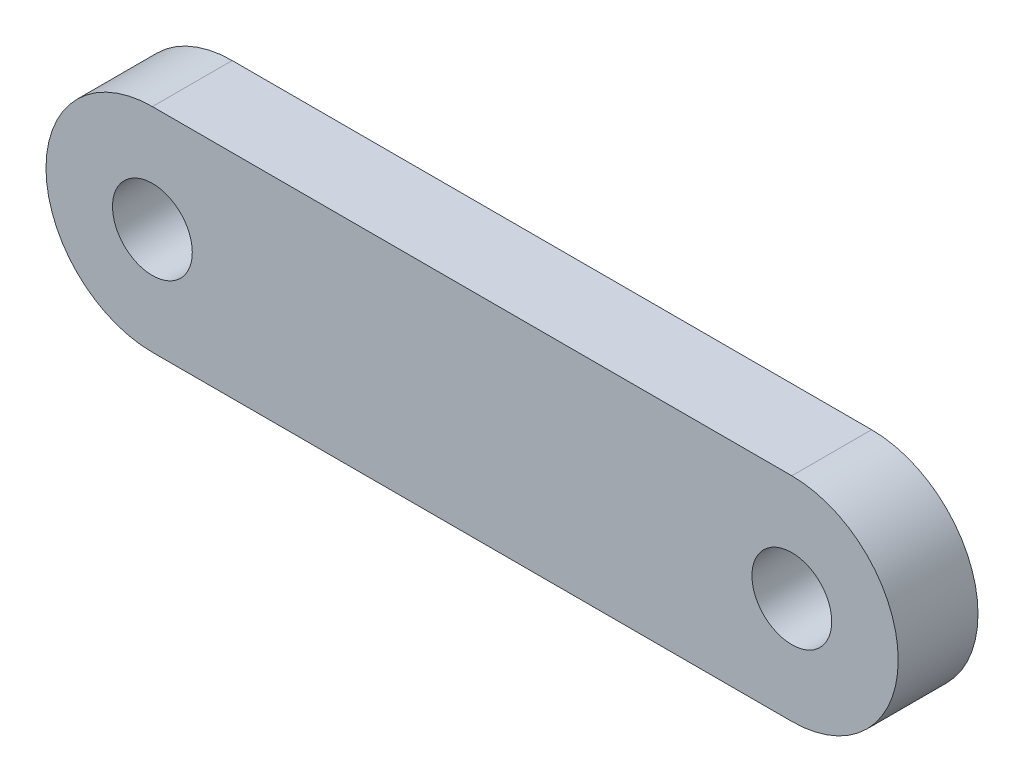
ISO-10303-21;
HEADER;
FILE_DESCRIPTION(('STEP AP214'),'2;1');
FILE_NAME('part.step','',(''),(''),'','','');
FILE_SCHEMA(('AUTOMOTIVE_DESIGN { 1 0 10303 214 1 1 1 1 }'));
ENDSEC;
DATA;
#1=APPLICATION_CONTEXT('core data for automotive mechanical design processes');
#2=APPLICATION_PROTOCOL_DEFINITION('international standard','automotive_design',2000,#1);
#3=PRODUCT_CONTEXT('',#1,'mechanical');
#4=PRODUCT('Part','Part','',(#3));
#5=PRODUCT_RELATED_PRODUCT_CATEGORY('part','',(#4));
#6=PRODUCT_DEFINITION_FORMATION('','',#4);
#7=PRODUCT_DEFINITION_CONTEXT('part definition',#1,'design');
#8=PRODUCT_DEFINITION('design','',#6,#7);
#9=PRODUCT_DEFINITION_SHAPE('','',#8);
#10=(LENGTH_UNIT() NAMED_UNIT(*) SI_UNIT(.MILLI.,.METRE.));
#11=(NAMED_UNIT(*) PLANE_ANGLE_UNIT() SI_UNIT($,.RADIAN.));
#12=(NAMED_UNIT(*) SI_UNIT($,.STERADIAN.) SOLID_ANGLE_UNIT());
#13=UNCERTAINTY_MEASURE_WITH_UNIT(LENGTH_MEASURE(1.E-05),#10,'distance_accuracy_value','');
#14=(GEOMETRIC_REPRESENTATION_CONTEXT(3) GLOBAL_UNCERTAINTY_ASSIGNED_CONTEXT((#13)) GLOBAL_UNIT_ASSIGNED_CONTEXT((#10,
#11,#12)) REPRESENTATION_CONTEXT('',''));
#15=CARTESIAN_POINT('',(0.,0.,0.));
#16=DIRECTION('',(0.,0.,1.));
#17=DIRECTION('',(1.,0.,0.));
#18=AXIS2_PLACEMENT_3D('',#15,#16,#17);
#19=CARTESIAN_POINT('',(0.,0.,0.75));
#20=DIRECTION('',(0.,0.,1.));
#21=DIRECTION('',(1.,0.,0.));
#22=AXIS2_PLACEMENT_3D('',#19,#20,#21);
#23=PLANE('',#22);
#24=CARTESIAN_POINT('',(0.,0.,0.75));
#25=DIRECTION('',(0.,0.,1.));
#26=DIRECTION('',(1.,0.,0.));
#27=AXIS2_PLACEMENT_3D('',#24,#25,#26);
#28=CIRCLE('',#27,0.75);
#29=CARTESIAN_POINT('',(0.75,0.,0.75));
#30=VERTEX_POINT('',#29);
#31=EDGE_CURVE('E101',#30,#30,#28,.T.);
#32=ORIENTED_EDGE('',*,*,#31,.F.);
#33=EDGE_LOOP('',(#32));
#34=FACE_BOUND('',#33,.T.);
#35=CARTESIAN_POINT('',(0.,0.,0.75));
#36=DIRECTION('',(0.,0.,1.));
#37=DIRECTION('',(1.,0.,0.));
#38=AXIS2_PLACEMENT_3D('',#35,#36,#37);
#39=CIRCLE('',#38,2.);
#40=CARTESIAN_POINT('',(0.,2.,0.75));
#41=VERTEX_POINT('',#40);
#42=CARTESIAN_POINT('',(0.,-2.,0.75));
#43=VERTEX_POINT('',#42);
#44=EDGE_CURVE('E86',#41,#43,#39,.T.);
#45=ORIENTED_EDGE('',*,*,#44,.T.);
#46=DIRECTION('',(1.,0.,0.));
#47=VECTOR('',#46,1.);
#48=CARTESIAN_POINT('',(0.,-2.,0.75));
#49=LINE('',#48,#47);
#50=CARTESIAN_POINT('',(12.02,-2.,0.75));
#51=VERTEX_POINT('',#50);
#52=EDGE_CURVE('E81',#43,#51,#49,.T.);
#53=ORIENTED_EDGE('',*,*,#52,.T.);
#54=CARTESIAN_POINT('',(12.02,0.,0.75));
#55=DIRECTION('',(0.,0.,1.));
#56=DIRECTION('',(1.,0.,0.));
#57=AXIS2_PLACEMENT_3D('',#54,#55,#56);
#58=CIRCLE('',#57,2.);
#59=CARTESIAN_POINT('',(12.02,2.,0.75));
#60=VERTEX_POINT('',#59);
#61=EDGE_CURVE('E84',#51,#60,#58,.T.);
#62=ORIENTED_EDGE('',*,*,#61,.T.);
#63=DIRECTION('',(-1.,0.,0.));
#64=VECTOR('',#63,1.);
#65=CARTESIAN_POINT('',(0.,2.,0.75));
#66=LINE('',#65,#64);
#67=EDGE_CURVE('E51',#60,#41,#66,.T.);
#68=ORIENTED_EDGE('',*,*,#67,.T.);
#69=EDGE_LOOP('',(#45,#53,#62,#68));
#70=FACE_BOUND('',#69,.T.);
#71=CARTESIAN_POINT('',(12.02,0.,0.75));
#72=DIRECTION('',(0.,0.,1.));
#73=DIRECTION('',(1.,0.,0.));
#74=AXIS2_PLACEMENT_3D('',#71,#72,#73);
#75=CIRCLE('',#74,0.750000000000002);
#76=CARTESIAN_POINT('',(12.77,0.,0.75));
#77=VERTEX_POINT('',#76);
#78=EDGE_CURVE('E116',#77,#77,#75,.T.);
#79=ORIENTED_EDGE('',*,*,#78,.F.);
#80=EDGE_LOOP('',(#79));
#81=FACE_BOUND('',#80,.T.);
#82=ADVANCED_FACE('F34',(#34,#70,#81),#23,.T.);
#83=CARTESIAN_POINT('',(0.,0.,-0.75));
#84=DIRECTION('',(0.,0.,1.));
#85=DIRECTION('',(1.,0.,0.));
#86=AXIS2_PLACEMENT_3D('',#83,#84,#85);
#87=PLANE('',#86);
#88=CARTESIAN_POINT('',(0.,0.,-0.75));
#89=DIRECTION('',(0.,0.,1.));
#90=DIRECTION('',(1.,0.,0.));
#91=AXIS2_PLACEMENT_3D('',#88,#89,#90);
#92=CIRCLE('',#91,2.);
#93=CARTESIAN_POINT('',(0.,2.,-0.75));
#94=VERTEX_POINT('',#93);
#95=CARTESIAN_POINT('',(0.,-2.,-0.75));
#96=VERTEX_POINT('',#95);
#97=EDGE_CURVE('E98',#94,#96,#92,.T.);
#98=ORIENTED_EDGE('',*,*,#97,.F.);
#99=DIRECTION('',(-1.,0.,0.));
#100=VECTOR('',#99,1.);
#101=CARTESIAN_POINT('',(0.,2.,-0.75));
#102=LINE('',#101,#100);
#103=CARTESIAN_POINT('',(12.02,2.,-0.75));
#104=VERTEX_POINT('',#103);
#105=EDGE_CURVE('E74',#104,#94,#102,.T.);
#106=ORIENTED_EDGE('',*,*,#105,.F.);
#107=CARTESIAN_POINT('',(12.02,0.,-0.75));
#108=DIRECTION('',(0.,0.,1.));
#109=DIRECTION('',(1.,0.,0.));
#110=AXIS2_PLACEMENT_3D('',#107,#108,#109);
#111=CIRCLE('',#110,2.);
#112=CARTESIAN_POINT('',(12.02,-2.,-0.75));
#113=VERTEX_POINT('',#112);
#114=EDGE_CURVE('E68',#113,#104,#111,.T.);
#115=ORIENTED_EDGE('',*,*,#114,.F.);
#116=DIRECTION('',(1.,0.,0.));
#117=VECTOR('',#116,1.);
#118=CARTESIAN_POINT('',(0.,-2.,-0.75));
#119=LINE('',#118,#117);
#120=EDGE_CURVE('E90',#96,#113,#119,.T.);
#121=ORIENTED_EDGE('',*,*,#120,.F.);
#122=EDGE_LOOP('',(#98,#106,#115,#121));
#123=FACE_BOUND('',#122,.T.);
#124=CARTESIAN_POINT('',(0.,0.,-0.75));
#125=DIRECTION('',(0.,0.,1.));
#126=DIRECTION('',(1.,0.,0.));
#127=AXIS2_PLACEMENT_3D('',#124,#125,#126);
#128=CIRCLE('',#127,0.75);
#129=CARTESIAN_POINT('',(0.75,0.,-0.75));
#130=VERTEX_POINT('',#129);
#131=EDGE_CURVE('E113',#130,#130,#128,.T.);
#132=ORIENTED_EDGE('',*,*,#131,.T.);
#133=EDGE_LOOP('',(#132));
#134=FACE_BOUND('',#133,.T.);
#135=CARTESIAN_POINT('',(12.02,0.,-0.75));
#136=DIRECTION('',(0.,0.,1.));
#137=DIRECTION('',(1.,0.,0.));
#138=AXIS2_PLACEMENT_3D('',#135,#136,#137);
#139=CIRCLE('',#138,0.750000000000002);
#140=CARTESIAN_POINT('',(12.77,0.,-0.75));
#141=VERTEX_POINT('',#140);
#142=EDGE_CURVE('E119',#141,#141,#139,.T.);
#143=ORIENTED_EDGE('',*,*,#142,.T.);
#144=EDGE_LOOP('',(#143));
#145=FACE_BOUND('',#144,.T.);
#146=ADVANCED_FACE('F109',(#123,#134,#145),#87,.F.);
#147=CARTESIAN_POINT('',(0.,0.,0.75));
#148=DIRECTION('',(0.,0.,-1.));
#149=DIRECTION('',(-1.,0.,0.));
#150=AXIS2_PLACEMENT_3D('',#147,#148,#149);
#151=CYLINDRICAL_SURFACE('',#150,2.);
#152=ORIENTED_EDGE('',*,*,#97,.T.);
#153=DIRECTION('',(0.,0.,-1.));
#154=VECTOR('',#153,1.);
#155=CARTESIAN_POINT('',(0.,-2.,0.75));
#156=LINE('',#155,#154);
#157=EDGE_CURVE('E11',#43,#96,#156,.T.);
#158=ORIENTED_EDGE('',*,*,#157,.F.);
#159=ORIENTED_EDGE('',*,*,#44,.F.);
#160=DIRECTION('',(0.,0.,-1.));
#161=VECTOR('',#160,1.);
#162=CARTESIAN_POINT('',(0.,2.,0.75));
#163=LINE('',#162,#161);
#164=EDGE_CURVE('E94',#41,#94,#163,.T.);
#165=ORIENTED_EDGE('',*,*,#164,.T.);
#166=EDGE_LOOP('',(#152,#158,#159,#165));
#167=FACE_BOUND('',#166,.T.);
#168=ADVANCED_FACE('F36',(#167),#151,.T.);
#169=CARTESIAN_POINT('',(0.,-2.,0.75));
#170=DIRECTION('',(0.,1.,0.));
#171=DIRECTION('',(0.,0.,1.));
#172=AXIS2_PLACEMENT_3D('',#169,#170,#171);
#173=PLANE('',#172);
#174=ORIENTED_EDGE('',*,*,#120,.T.);
#175=DIRECTION('',(0.,0.,-1.));
#176=VECTOR('',#175,1.);
#177=CARTESIAN_POINT('',(12.02,-2.,0.75));
#178=LINE('',#177,#176);
#179=EDGE_CURVE('E43',#51,#113,#178,.T.);
#180=ORIENTED_EDGE('',*,*,#179,.F.);
#181=ORIENTED_EDGE('',*,*,#52,.F.);
#182=ORIENTED_EDGE('',*,*,#157,.T.);
#183=EDGE_LOOP('',(#174,#180,#181,#182));
#184=FACE_BOUND('',#183,.T.);
#185=ADVANCED_FACE('F89',(#184),#173,.F.);
#186=CARTESIAN_POINT('',(12.02,0.,0.75));
#187=DIRECTION('',(0.,0.,-1.));
#188=DIRECTION('',(-1.,0.,0.));
#189=AXIS2_PLACEMENT_3D('',#186,#187,#188);
#190=CYLINDRICAL_SURFACE('',#189,2.);
#191=ORIENTED_EDGE('',*,*,#114,.T.);
#192=DIRECTION('',(0.,0.,-1.));
#193=VECTOR('',#192,1.);
#194=CARTESIAN_POINT('',(12.02,2.,0.75));
#195=LINE('',#194,#193);
#196=EDGE_CURVE('E91',#60,#104,#195,.T.);
#197=ORIENTED_EDGE('',*,*,#196,.F.);
#198=ORIENTED_EDGE('',*,*,#61,.F.);
#199=ORIENTED_EDGE('',*,*,#179,.T.);
#200=EDGE_LOOP('',(#191,#197,#198,#199));
#201=FACE_BOUND('',#200,.T.);
#202=ADVANCED_FACE('F92',(#201),#190,.T.);
#203=CARTESIAN_POINT('',(0.,2.,0.75));
#204=DIRECTION('',(0.,-1.,0.));
#205=DIRECTION('',(0.,0.,-1.));
#206=AXIS2_PLACEMENT_3D('',#203,#204,#205);
#207=PLANE('',#206);
#208=ORIENTED_EDGE('',*,*,#105,.T.);
#209=ORIENTED_EDGE('',*,*,#164,.F.);
#210=ORIENTED_EDGE('',*,*,#67,.F.);
#211=ORIENTED_EDGE('',*,*,#196,.T.);
#212=EDGE_LOOP('',(#208,#209,#210,#211));
#213=FACE_BOUND('',#212,.T.);
#214=ADVANCED_FACE('F106',(#213),#207,.F.);
#215=CARTESIAN_POINT('',(0.,0.,0.75));
#216=DIRECTION('',(0.,0.,-1.));
#217=DIRECTION('',(-1.,0.,0.));
#218=AXIS2_PLACEMENT_3D('',#215,#216,#217);
#219=CYLINDRICAL_SURFACE('',#218,0.75);
#220=ORIENTED_EDGE('',*,*,#31,.T.);
#221=EDGE_LOOP('',(#220));
#222=FACE_BOUND('',#221,.T.);
#223=ORIENTED_EDGE('',*,*,#131,.F.);
#224=EDGE_LOOP('',(#223));
#225=FACE_BOUND('',#224,.T.);
#226=ADVANCED_FACE('F136',(#222,#225),#219,.F.);
#227=CARTESIAN_POINT('',(12.02,0.,0.75));
#228=DIRECTION('',(0.,0.,-1.));
#229=DIRECTION('',(-1.,0.,0.));
#230=AXIS2_PLACEMENT_3D('',#227,#228,#229);
#231=CYLINDRICAL_SURFACE('',#230,0.750000000000002);
#232=ORIENTED_EDGE('',*,*,#78,.T.);
#233=EDGE_LOOP('',(#232));
#234=FACE_BOUND('',#233,.T.);
#235=ORIENTED_EDGE('',*,*,#142,.F.);
#236=EDGE_LOOP('',(#235));
#237=FACE_BOUND('',#236,.T.);
#238=ADVANCED_FACE('F125',(#234,#237),#231,.F.);
#239=CLOSED_SHELL('',(#82,#146,#168,#185,#202,#214,#226,#238));
#240=MANIFOLD_SOLID_BREP('B2',#239);
#241=ADVANCED_BREP_SHAPE_REPRESENTATION('',(#18,#240),#14);
#242=SHAPE_DEFINITION_REPRESENTATION(#9,#241);
ENDSEC;
END-ISO-10303-21;
